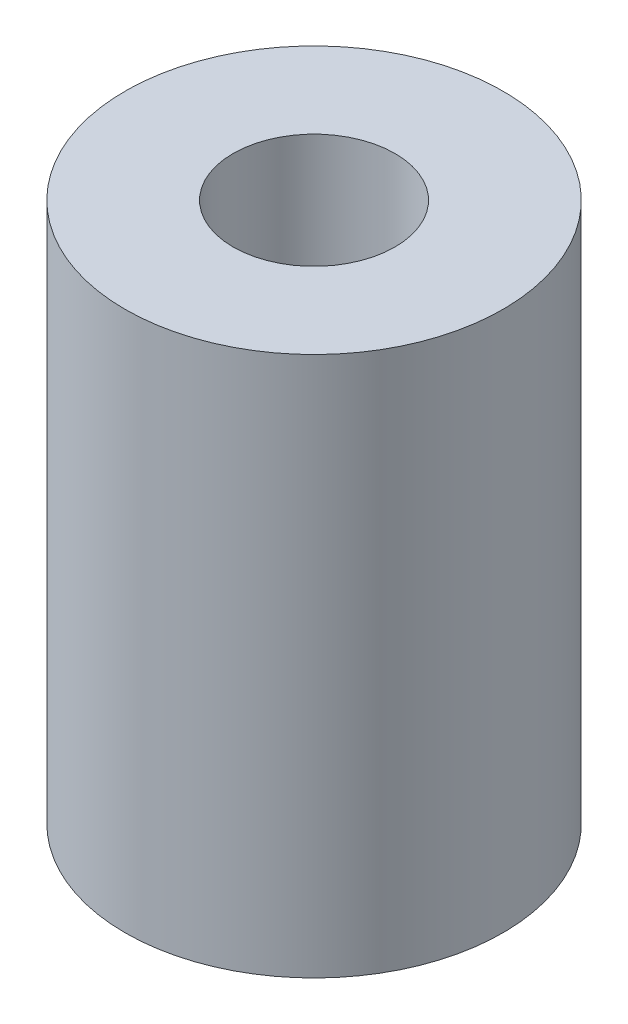
ISO-10303-21;
HEADER;
FILE_DESCRIPTION(('STEP AP214'),'2;1');
FILE_NAME('part.step','',(''),(''),'','','');
FILE_SCHEMA(('AUTOMOTIVE_DESIGN { 1 0 10303 214 1 1 1 1 }'));
ENDSEC;
DATA;
#1=APPLICATION_CONTEXT('core data for automotive mechanical design processes');
#2=APPLICATION_PROTOCOL_DEFINITION('international standard','automotive_design',2000,#1);
#3=PRODUCT_CONTEXT('',#1,'mechanical');
#4=PRODUCT('Part','Part','',(#3));
#5=PRODUCT_RELATED_PRODUCT_CATEGORY('part','',(#4));
#6=PRODUCT_DEFINITION_FORMATION('','',#4);
#7=PRODUCT_DEFINITION_CONTEXT('part definition',#1,'design');
#8=PRODUCT_DEFINITION('design','',#6,#7);
#9=PRODUCT_DEFINITION_SHAPE('','',#8);
#10=(LENGTH_UNIT() NAMED_UNIT(*) SI_UNIT(.MILLI.,.METRE.));
#11=(NAMED_UNIT(*) PLANE_ANGLE_UNIT() SI_UNIT($,.RADIAN.));
#12=(NAMED_UNIT(*) SI_UNIT($,.STERADIAN.) SOLID_ANGLE_UNIT());
#13=UNCERTAINTY_MEASURE_WITH_UNIT(LENGTH_MEASURE(1.E-05),#10,'distance_accuracy_value','');
#14=(GEOMETRIC_REPRESENTATION_CONTEXT(3) GLOBAL_UNCERTAINTY_ASSIGNED_CONTEXT((#13)) GLOBAL_UNIT_ASSIGNED_CONTEXT((#10,
#11,#12)) REPRESENTATION_CONTEXT('',''));
#15=CARTESIAN_POINT('',(0.,0.,0.));
#16=DIRECTION('',(0.,0.,1.));
#17=DIRECTION('',(1.,0.,0.));
#18=AXIS2_PLACEMENT_3D('',#15,#16,#17);
#19=CARTESIAN_POINT('',(0.,10.,0.));
#20=DIRECTION('',(0.,1.,0.));
#21=DIRECTION('',(0.,0.,1.));
#22=AXIS2_PLACEMENT_3D('',#19,#20,#21);
#23=PLANE('',#22);
#24=CARTESIAN_POINT('',(0.,10.,0.));
#25=DIRECTION('',(0.,1.,0.));
#26=DIRECTION('',(0.,0.,1.));
#27=AXIS2_PLACEMENT_3D('',#24,#25,#26);
#28=CIRCLE('',#27,3.5);
#29=CARTESIAN_POINT('',(0.,10.,3.5));
#30=VERTEX_POINT('',#29);
#31=EDGE_CURVE('E10',#30,#30,#28,.T.);
#32=ORIENTED_EDGE('',*,*,#31,.T.);
#33=EDGE_LOOP('',(#32));
#34=FACE_BOUND('',#33,.T.);
#35=CARTESIAN_POINT('',(0.,10.,0.));
#36=DIRECTION('',(0.,1.,0.));
#37=DIRECTION('',(0.,0.,1.));
#38=AXIS2_PLACEMENT_3D('',#35,#36,#37);
#39=CIRCLE('',#38,1.5);
#40=CARTESIAN_POINT('',(0.,10.,1.5));
#41=VERTEX_POINT('',#40);
#42=EDGE_CURVE('E43',#41,#41,#39,.T.);
#43=ORIENTED_EDGE('',*,*,#42,.F.);
#44=EDGE_LOOP('',(#43));
#45=FACE_BOUND('',#44,.T.);
#46=ADVANCED_FACE('F32',(#34,#45),#23,.T.);
#47=CARTESIAN_POINT('',(0.,0.,0.));
#48=DIRECTION('',(0.,1.,0.));
#49=DIRECTION('',(0.,0.,1.));
#50=AXIS2_PLACEMENT_3D('',#47,#48,#49);
#51=PLANE('',#50);
#52=CARTESIAN_POINT('',(0.,0.,0.));
#53=DIRECTION('',(0.,1.,0.));
#54=DIRECTION('',(0.,0.,1.));
#55=AXIS2_PLACEMENT_3D('',#52,#53,#54);
#56=CIRCLE('',#55,3.5);
#57=CARTESIAN_POINT('',(0.,0.,3.5));
#58=VERTEX_POINT('',#57);
#59=EDGE_CURVE('E36',#58,#58,#56,.T.);
#60=ORIENTED_EDGE('',*,*,#59,.F.);
#61=EDGE_LOOP('',(#60));
#62=FACE_BOUND('',#61,.T.);
#63=CARTESIAN_POINT('',(0.,0.,0.));
#64=DIRECTION('',(0.,1.,0.));
#65=DIRECTION('',(0.,0.,1.));
#66=AXIS2_PLACEMENT_3D('',#63,#64,#65);
#67=CIRCLE('',#66,1.5);
#68=CARTESIAN_POINT('',(0.,0.,1.5));
#69=VERTEX_POINT('',#68);
#70=EDGE_CURVE('E45',#69,#69,#67,.T.);
#71=ORIENTED_EDGE('',*,*,#70,.T.);
#72=EDGE_LOOP('',(#71));
#73=FACE_BOUND('',#72,.T.);
#74=ADVANCED_FACE('F55',(#62,#73),#51,.F.);
#75=CARTESIAN_POINT('',(0.,10.,0.));
#76=DIRECTION('',(0.,-1.,0.));
#77=DIRECTION('',(0.,0.,-1.));
#78=AXIS2_PLACEMENT_3D('',#75,#76,#77);
#79=CYLINDRICAL_SURFACE('',#78,3.5);
#80=ORIENTED_EDGE('',*,*,#31,.F.);
#81=EDGE_LOOP('',(#80));
#82=FACE_BOUND('',#81,.T.);
#83=ORIENTED_EDGE('',*,*,#59,.T.);
#84=EDGE_LOOP('',(#83));
#85=FACE_BOUND('',#84,.T.);
#86=ADVANCED_FACE('F34',(#82,#85),#79,.T.);
#87=CARTESIAN_POINT('',(0.,10.,0.));
#88=DIRECTION('',(0.,-1.,0.));
#89=DIRECTION('',(0.,0.,-1.));
#90=AXIS2_PLACEMENT_3D('',#87,#88,#89);
#91=CYLINDRICAL_SURFACE('',#90,1.5);
#92=ORIENTED_EDGE('',*,*,#42,.T.);
#93=EDGE_LOOP('',(#92));
#94=FACE_BOUND('',#93,.T.);
#95=ORIENTED_EDGE('',*,*,#70,.F.);
#96=EDGE_LOOP('',(#95));
#97=FACE_BOUND('',#96,.T.);
#98=ADVANCED_FACE('F51',(#94,#97),#91,.F.);
#99=CLOSED_SHELL('',(#46,#74,#86,#98));
#100=MANIFOLD_SOLID_BREP('B2',#99);
#101=ADVANCED_BREP_SHAPE_REPRESENTATION('',(#18,#100),#14);
#102=SHAPE_DEFINITION_REPRESENTATION(#9,#101);
ENDSEC;
END-ISO-10303-21;
